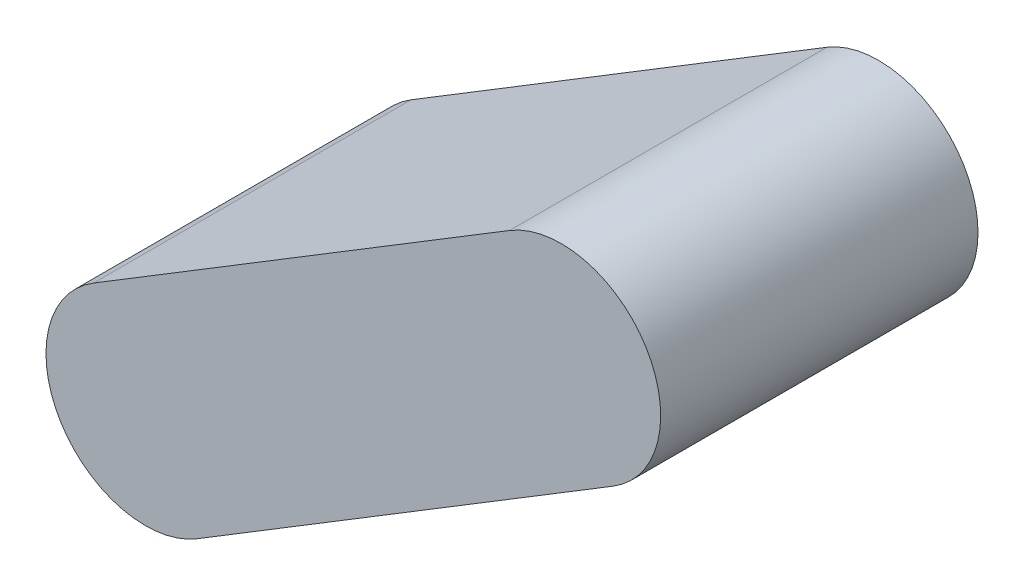
ISO-10303-21;
HEADER;
FILE_DESCRIPTION(('STEP AP214'),'2;1');
FILE_NAME('part.step','',(''),(''),'','','');
FILE_SCHEMA(('AUTOMOTIVE_DESIGN { 1 0 10303 214 1 1 1 1 }'));
ENDSEC;
DATA;
#1=APPLICATION_CONTEXT('core data for automotive mechanical design processes');
#2=APPLICATION_PROTOCOL_DEFINITION('international standard','automotive_design',2000,#1);
#3=PRODUCT_CONTEXT('',#1,'mechanical');
#4=PRODUCT('Part','Part','',(#3));
#5=PRODUCT_RELATED_PRODUCT_CATEGORY('part','',(#4));
#6=PRODUCT_DEFINITION_FORMATION('','',#4);
#7=PRODUCT_DEFINITION_CONTEXT('part definition',#1,'design');
#8=PRODUCT_DEFINITION('design','',#6,#7);
#9=PRODUCT_DEFINITION_SHAPE('','',#8);
#10=(LENGTH_UNIT() NAMED_UNIT(*) SI_UNIT(.MILLI.,.METRE.));
#11=(NAMED_UNIT(*) PLANE_ANGLE_UNIT() SI_UNIT($,.RADIAN.));
#12=(NAMED_UNIT(*) SI_UNIT($,.STERADIAN.) SOLID_ANGLE_UNIT());
#13=UNCERTAINTY_MEASURE_WITH_UNIT(LENGTH_MEASURE(1.E-05),#10,'distance_accuracy_value','');
#14=(GEOMETRIC_REPRESENTATION_CONTEXT(3) GLOBAL_UNCERTAINTY_ASSIGNED_CONTEXT((#13)) GLOBAL_UNIT_ASSIGNED_CONTEXT((#10,
#11,#12)) REPRESENTATION_CONTEXT('',''));
#15=CARTESIAN_POINT('',(0.,0.,0.));
#16=DIRECTION('',(0.,0.,1.));
#17=DIRECTION('',(1.,0.,0.));
#18=AXIS2_PLACEMENT_3D('',#15,#16,#17);
#19=CARTESIAN_POINT('',(-690.550000025001,507.4,159.639));
#20=DIRECTION('',(0.,0.,-1.));
#21=DIRECTION('',(-1.,0.,0.));
#22=AXIS2_PLACEMENT_3D('',#19,#20,#21);
#23=CYLINDRICAL_SURFACE('',#22,100.000000025001);
#24=CARTESIAN_POINT('',(-690.550000025001,507.4,-159.639));
#25=DIRECTION('',(0.,0.,1.));
#26=DIRECTION('',(-1.,0.,0.));
#27=AXIS2_PLACEMENT_3D('',#24,#25,#26);
#28=CIRCLE('',#27,100.000000025001);
#29=CARTESIAN_POINT('',(-638.509183690561,422.008235524465,-159.639));
#30=VERTEX_POINT('',#29);
#31=CARTESIAN_POINT('',(-742.59081635944,592.791764475536,-159.639));
#32=VERTEX_POINT('',#31);
#33=EDGE_CURVE('E98',#30,#32,#28,.T.);
#34=ORIENTED_EDGE('',*,*,#33,.T.);
#35=DIRECTION('',(0.,0.,-1.));
#36=VECTOR('',#35,1.);
#37=CARTESIAN_POINT('',(-742.59081635944,592.791764475536,159.639));
#38=LINE('',#37,#36);
#39=CARTESIAN_POINT('',(-742.59081635944,592.791764475536,159.639));
#40=VERTEX_POINT('',#39);
#41=EDGE_CURVE('E11',#40,#32,#38,.T.);
#42=ORIENTED_EDGE('',*,*,#41,.F.);
#43=CARTESIAN_POINT('',(-690.550000025001,507.4,159.639));
#44=DIRECTION('',(0.,0.,1.));
#45=DIRECTION('',(-1.,0.,0.));
#46=AXIS2_PLACEMENT_3D('',#43,#44,#45);
#47=CIRCLE('',#46,100.000000025001);
#48=CARTESIAN_POINT('',(-638.509183690561,422.008235524465,159.639));
#49=VERTEX_POINT('',#48);
#50=EDGE_CURVE('E86',#49,#40,#47,.T.);
#51=ORIENTED_EDGE('',*,*,#50,.F.);
#52=DIRECTION('',(0.,0.,-1.));
#53=VECTOR('',#52,1.);
#54=CARTESIAN_POINT('',(-638.509183690561,422.008235524465,159.639));
#55=LINE('',#54,#53);
#56=EDGE_CURVE('E94',#49,#30,#55,.T.);
#57=ORIENTED_EDGE('',*,*,#56,.T.);
#58=EDGE_LOOP('',(#34,#42,#51,#57));
#59=FACE_BOUND('',#58,.T.);
#60=ADVANCED_FACE('F35',(#59),#23,.T.);
#61=CARTESIAN_POINT('',(-1161.01046218496,337.791764500535,159.639));
#62=DIRECTION('',(0.520408163214287,-0.853917644541868,0.));
#63=DIRECTION('',(0.853917644541868,0.520408163214287,0.));
#64=AXIS2_PLACEMENT_3D('',#61,#62,#63);
#65=PLANE('',#64);
#66=DIRECTION('',(-0.853917644541868,-0.520408163214287,0.));
#67=VECTOR('',#66,1.);
#68=CARTESIAN_POINT('',(-1161.01046218496,337.791764500535,-159.639));
#69=LINE('',#68,#67);
#70=CARTESIAN_POINT('',(-1161.01046218496,337.791764500535,-159.639));
#71=VERTEX_POINT('',#70);
#72=EDGE_CURVE('E90',#32,#71,#69,.T.);
#73=ORIENTED_EDGE('',*,*,#72,.T.);
#74=DIRECTION('',(0.,0.,-1.));
#75=VECTOR('',#74,1.);
#76=CARTESIAN_POINT('',(-1161.01046218496,337.791764500535,159.639));
#77=LINE('',#76,#75);
#78=CARTESIAN_POINT('',(-1161.01046218496,337.791764500535,159.639));
#79=VERTEX_POINT('',#78);
#80=EDGE_CURVE('E43',#79,#71,#77,.T.);
#81=ORIENTED_EDGE('',*,*,#80,.F.);
#82=DIRECTION('',(-0.853917644541868,-0.520408163214287,0.));
#83=VECTOR('',#82,1.);
#84=CARTESIAN_POINT('',(-1161.01046218496,337.791764500535,159.639));
#85=LINE('',#84,#83);
#86=EDGE_CURVE('E81',#40,#79,#85,.T.);
#87=ORIENTED_EDGE('',*,*,#86,.F.);
#88=ORIENTED_EDGE('',*,*,#41,.T.);
#89=EDGE_LOOP('',(#73,#81,#87,#88));
#90=FACE_BOUND('',#89,.T.);
#91=ADVANCED_FACE('F89',(#90),#65,.F.);
#92=CARTESIAN_POINT('',(-1108.96964585052,252.400000025,159.639));
#93=DIRECTION('',(0.,0.,-1.));
#94=DIRECTION('',(-1.,0.,0.));
#95=AXIS2_PLACEMENT_3D('',#92,#93,#94);
#96=CYLINDRICAL_SURFACE('',#95,100.000000025001);
#97=CARTESIAN_POINT('',(-1108.96964585052,252.400000025,-159.639));
#98=DIRECTION('',(0.,0.,1.));
#99=DIRECTION('',(1.,0.,0.));
#100=AXIS2_PLACEMENT_3D('',#97,#98,#99);
#101=CIRCLE('',#100,100.000000025001);
#102=CARTESIAN_POINT('',(-1056.92882951608,167.008235549465,-159.639));
#103=VERTEX_POINT('',#102);
#104=EDGE_CURVE('E68',#71,#103,#101,.T.);
#105=ORIENTED_EDGE('',*,*,#104,.T.);
#106=DIRECTION('',(0.,0.,-1.));
#107=VECTOR('',#106,1.);
#108=CARTESIAN_POINT('',(-1056.92882951608,167.008235549465,159.639));
#109=LINE('',#108,#107);
#110=CARTESIAN_POINT('',(-1056.92882951608,167.008235549465,159.639));
#111=VERTEX_POINT('',#110);
#112=EDGE_CURVE('E91',#111,#103,#109,.T.);
#113=ORIENTED_EDGE('',*,*,#112,.F.);
#114=CARTESIAN_POINT('',(-1108.96964585052,252.400000025,159.639));
#115=DIRECTION('',(0.,0.,1.));
#116=DIRECTION('',(1.,0.,0.));
#117=AXIS2_PLACEMENT_3D('',#114,#115,#116);
#118=CIRCLE('',#117,100.000000025001);
#119=EDGE_CURVE('E84',#79,#111,#118,.T.);
#120=ORIENTED_EDGE('',*,*,#119,.F.);
#121=ORIENTED_EDGE('',*,*,#80,.T.);
#122=EDGE_LOOP('',(#105,#113,#120,#121));
#123=FACE_BOUND('',#122,.T.);
#124=ADVANCED_FACE('F92',(#123),#96,.T.);
#125=CARTESIAN_POINT('',(-638.509183690561,422.008235524465,159.639));
#126=DIRECTION('',(-0.520408163214287,0.853917644541868,0.));
#127=DIRECTION('',(-0.853917644541868,-0.520408163214287,0.));
#128=AXIS2_PLACEMENT_3D('',#125,#126,#127);
#129=PLANE('',#128);
#130=DIRECTION('',(0.853917644541868,0.520408163214287,0.));
#131=VECTOR('',#130,1.);
#132=CARTESIAN_POINT('',(-638.509183690561,422.008235524465,-159.639));
#133=LINE('',#132,#131);
#134=EDGE_CURVE('E74',#103,#30,#133,.T.);
#135=ORIENTED_EDGE('',*,*,#134,.T.);
#136=ORIENTED_EDGE('',*,*,#56,.F.);
#137=DIRECTION('',(0.853917644541868,0.520408163214287,0.));
#138=VECTOR('',#137,1.);
#139=CARTESIAN_POINT('',(-638.509183690561,422.008235524465,159.639));
#140=LINE('',#139,#138);
#141=EDGE_CURVE('E51',#111,#49,#140,.T.);
#142=ORIENTED_EDGE('',*,*,#141,.F.);
#143=ORIENTED_EDGE('',*,*,#112,.T.);
#144=EDGE_LOOP('',(#135,#136,#142,#143));
#145=FACE_BOUND('',#144,.T.);
#146=ADVANCED_FACE('F105',(#145),#129,.F.);
#147=CARTESIAN_POINT('',(-690.550000025001,507.4,159.639));
#148=DIRECTION('',(0.,0.,-1.));
#149=DIRECTION('',(-1.,0.,0.));
#150=AXIS2_PLACEMENT_3D('',#147,#148,#149);
#151=PLANE('',#150);
#152=ORIENTED_EDGE('',*,*,#50,.T.);
#153=ORIENTED_EDGE('',*,*,#86,.T.);
#154=ORIENTED_EDGE('',*,*,#119,.T.);
#155=ORIENTED_EDGE('',*,*,#141,.T.);
#156=EDGE_LOOP('',(#152,#153,#154,#155));
#157=FACE_BOUND('',#156,.T.);
#158=ADVANCED_FACE('F82',(#157),#151,.F.);
#159=CARTESIAN_POINT('',(-690.550000025001,507.4,-159.639));
#160=DIRECTION('',(0.,0.,-1.));
#161=DIRECTION('',(-1.,0.,0.));
#162=AXIS2_PLACEMENT_3D('',#159,#160,#161);
#163=PLANE('',#162);
#164=ORIENTED_EDGE('',*,*,#33,.F.);
#165=ORIENTED_EDGE('',*,*,#134,.F.);
#166=ORIENTED_EDGE('',*,*,#104,.F.);
#167=ORIENTED_EDGE('',*,*,#72,.F.);
#168=EDGE_LOOP('',(#164,#165,#166,#167));
#169=FACE_BOUND('',#168,.T.);
#170=ADVANCED_FACE('F108',(#169),#163,.T.);
#171=CLOSED_SHELL('',(#60,#91,#124,#146,#158,#170));
#172=MANIFOLD_SOLID_BREP('B2',#171);
#173=ADVANCED_BREP_SHAPE_REPRESENTATION('',(#18,#172),#14);
#174=SHAPE_DEFINITION_REPRESENTATION(#9,#173);
ENDSEC;
END-ISO-10303-21;
